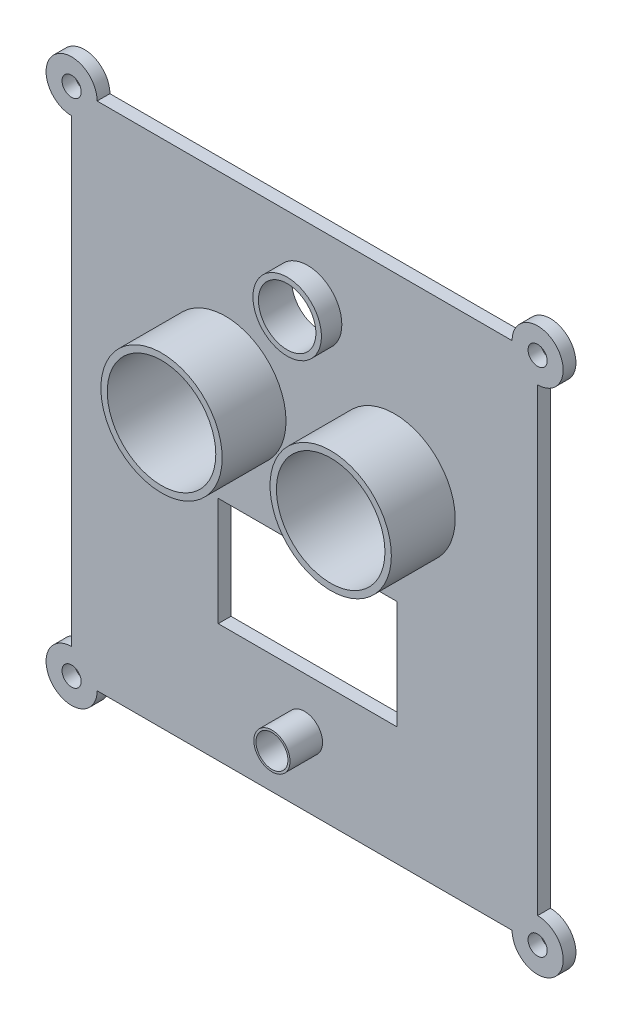
ISO-10303-21;
HEADER;
FILE_DESCRIPTION(('STEP AP214'),'2;1');
FILE_NAME('part.step','',(''),(''),'','','');
FILE_SCHEMA(('AUTOMOTIVE_DESIGN { 1 0 10303 214 1 1 1 1 }'));
ENDSEC;
DATA;
#1=APPLICATION_CONTEXT('core data for automotive mechanical design processes');
#2=APPLICATION_PROTOCOL_DEFINITION('international standard','automotive_design',2000,#1);
#3=PRODUCT_CONTEXT('',#1,'mechanical');
#4=PRODUCT('Part','Part','',(#3));
#5=PRODUCT_RELATED_PRODUCT_CATEGORY('part','',(#4));
#6=PRODUCT_DEFINITION_FORMATION('','',#4);
#7=PRODUCT_DEFINITION_CONTEXT('part definition',#1,'design');
#8=PRODUCT_DEFINITION('design','',#6,#7);
#9=PRODUCT_DEFINITION_SHAPE('','',#8);
#10=(LENGTH_UNIT() NAMED_UNIT(*) SI_UNIT(.MILLI.,.METRE.));
#11=(NAMED_UNIT(*) PLANE_ANGLE_UNIT() SI_UNIT($,.RADIAN.));
#12=(NAMED_UNIT(*) SI_UNIT($,.STERADIAN.) SOLID_ANGLE_UNIT());
#13=UNCERTAINTY_MEASURE_WITH_UNIT(LENGTH_MEASURE(1.E-05),#10,'distance_accuracy_value','');
#14=(GEOMETRIC_REPRESENTATION_CONTEXT(3) GLOBAL_UNCERTAINTY_ASSIGNED_CONTEXT((#13)) GLOBAL_UNIT_ASSIGNED_CONTEXT((#10,
#11,#12)) REPRESENTATION_CONTEXT('',''));
#15=CARTESIAN_POINT('',(0.,0.,0.));
#16=DIRECTION('',(0.,0.,1.));
#17=DIRECTION('',(1.,0.,0.));
#18=AXIS2_PLACEMENT_3D('',#15,#16,#17);
#19=CARTESIAN_POINT('',(0.,0.,2.));
#20=DIRECTION('',(0.,0.,1.));
#21=DIRECTION('',(1.,0.,0.));
#22=AXIS2_PLACEMENT_3D('',#19,#20,#21);
#23=PLANE('',#22);
#24=CARTESIAN_POINT('',(14.0850954924085,21.3730162148261,2.));
#25=DIRECTION('',(0.,0.,1.));
#26=DIRECTION('',(1.,0.,0.));
#27=AXIS2_PLACEMENT_3D('',#24,#25,#26);
#28=CIRCLE('',#27,9.5);
#29=CARTESIAN_POINT('',(23.5850954924085,21.3730162148261,2.));
#30=VERTEX_POINT('',#29);
#31=EDGE_CURVE('E361',#30,#30,#28,.T.);
#32=ORIENTED_EDGE('',*,*,#31,.F.);
#33=EDGE_LOOP('',(#32));
#34=FACE_BOUND('',#33,.T.);
#35=DIRECTION('',(-1.,0.,0.));
#36=VECTOR('',#35,1.);
#37=CARTESIAN_POINT('',(-13.5319148866655,5.58817290968342,2.));
#38=LINE('',#37,#36);
#39=CARTESIAN_POINT('',(14.4680851133345,5.58817290968342,2.));
#40=VERTEX_POINT('',#39);
#41=CARTESIAN_POINT('',(-13.5319148866655,5.58817290968342,2.));
#42=VERTEX_POINT('',#41);
#43=EDGE_CURVE('E185',#40,#42,#38,.T.);
#44=ORIENTED_EDGE('',*,*,#43,.F.);
#45=DIRECTION('',(0.,1.,0.));
#46=VECTOR('',#45,1.);
#47=CARTESIAN_POINT('',(14.4680851133345,-11.4118270903166,2.));
#48=LINE('',#47,#46);
#49=CARTESIAN_POINT('',(14.4680851133345,-11.4118270903166,2.));
#50=VERTEX_POINT('',#49);
#51=EDGE_CURVE('E183',#50,#40,#48,.T.);
#52=ORIENTED_EDGE('',*,*,#51,.F.);
#53=DIRECTION('',(1.,0.,0.));
#54=VECTOR('',#53,1.);
#55=CARTESIAN_POINT('',(-13.5319148866655,-11.4118270903166,2.));
#56=LINE('',#55,#54);
#57=CARTESIAN_POINT('',(-13.5319148866655,-11.4118270903166,2.));
#58=VERTEX_POINT('',#57);
#59=EDGE_CURVE('E191',#58,#50,#56,.T.);
#60=ORIENTED_EDGE('',*,*,#59,.F.);
#61=DIRECTION('',(0.,-1.,0.));
#62=VECTOR('',#61,1.);
#63=CARTESIAN_POINT('',(-13.5319148866655,-11.4118270903166,2.));
#64=LINE('',#63,#62);
#65=EDGE_CURVE('E188',#42,#58,#64,.T.);
#66=ORIENTED_EDGE('',*,*,#65,.F.);
#67=EDGE_LOOP('',(#44,#52,#60,#66));
#68=FACE_BOUND('',#67,.T.);
#69=DIRECTION('',(0.,-1.,0.));
#70=VECTOR('',#69,1.);
#71=CARTESIAN_POINT('',(-36.5,50.,2.));
#72=LINE('',#71,#70);
#73=CARTESIAN_POINT('',(-36.5,46.,2.));
#74=VERTEX_POINT('',#73);
#75=CARTESIAN_POINT('',(-36.5,-26.,2.));
#76=VERTEX_POINT('',#75);
#77=EDGE_CURVE('E226',#74,#76,#72,.T.);
#78=ORIENTED_EDGE('',*,*,#77,.T.);
#79=CARTESIAN_POINT('',(-36.5,-30.,2.));
#80=DIRECTION('',(0.,0.,1.));
#81=DIRECTION('',(1.,0.,0.));
#82=AXIS2_PLACEMENT_3D('',#79,#80,#81);
#83=CIRCLE('',#82,4.00000000000001);
#84=CARTESIAN_POINT('',(-32.5,-30.,2.));
#85=VERTEX_POINT('',#84);
#86=EDGE_CURVE('E149',#76,#85,#83,.T.);
#87=ORIENTED_EDGE('',*,*,#86,.T.);
#88=DIRECTION('',(1.,0.,0.));
#89=VECTOR('',#88,1.);
#90=CARTESIAN_POINT('',(-36.5,-30.,2.));
#91=LINE('',#90,#89);
#92=CARTESIAN_POINT('',(32.5,-30.,2.));
#93=VERTEX_POINT('',#92);
#94=EDGE_CURVE('E142',#85,#93,#91,.T.);
#95=ORIENTED_EDGE('',*,*,#94,.T.);
#96=CARTESIAN_POINT('',(36.5,-30.,2.));
#97=DIRECTION('',(0.,0.,1.));
#98=DIRECTION('',(1.,0.,0.));
#99=AXIS2_PLACEMENT_3D('',#96,#97,#98);
#100=CIRCLE('',#99,4.00000000000001);
#101=CARTESIAN_POINT('',(36.5,-26.,2.));
#102=VERTEX_POINT('',#101);
#103=EDGE_CURVE('E151',#93,#102,#100,.T.);
#104=ORIENTED_EDGE('',*,*,#103,.T.);
#105=DIRECTION('',(0.,1.,0.));
#106=VECTOR('',#105,1.);
#107=CARTESIAN_POINT('',(36.5,50.,2.));
#108=LINE('',#107,#106);
#109=CARTESIAN_POINT('',(36.5,46.,2.));
#110=VERTEX_POINT('',#109);
#111=EDGE_CURVE('E138',#102,#110,#108,.T.);
#112=ORIENTED_EDGE('',*,*,#111,.T.);
#113=CARTESIAN_POINT('',(36.5,50.,2.));
#114=DIRECTION('',(0.,0.,1.));
#115=DIRECTION('',(1.,0.,0.));
#116=AXIS2_PLACEMENT_3D('',#113,#114,#115);
#117=CIRCLE('',#116,4.);
#118=CARTESIAN_POINT('',(32.5,50.,2.));
#119=VERTEX_POINT('',#118);
#120=EDGE_CURVE('E161',#110,#119,#117,.T.);
#121=ORIENTED_EDGE('',*,*,#120,.T.);
#122=DIRECTION('',(-1.,0.,0.));
#123=VECTOR('',#122,1.);
#124=CARTESIAN_POINT('',(-36.5,50.,2.));
#125=LINE('',#124,#123);
#126=CARTESIAN_POINT('',(-32.5,50.,2.));
#127=VERTEX_POINT('',#126);
#128=EDGE_CURVE('E224',#119,#127,#125,.T.);
#129=ORIENTED_EDGE('',*,*,#128,.T.);
#130=CARTESIAN_POINT('',(-36.5,50.,2.));
#131=DIRECTION('',(0.,0.,1.));
#132=DIRECTION('',(1.,0.,0.));
#133=AXIS2_PLACEMENT_3D('',#130,#131,#132);
#134=CIRCLE('',#133,4.);
#135=EDGE_CURVE('E170',#127,#74,#134,.T.);
#136=ORIENTED_EDGE('',*,*,#135,.T.);
#137=EDGE_LOOP('',(#78,#87,#95,#104,#112,#121,#129,#136));
#138=FACE_BOUND('',#137,.T.);
#139=CARTESIAN_POINT('',(-36.5,50.,2.));
#140=DIRECTION('',(0.,0.,1.));
#141=DIRECTION('',(1.,0.,0.));
#142=AXIS2_PLACEMENT_3D('',#139,#140,#141);
#143=CIRCLE('',#142,1.5);
#144=CARTESIAN_POINT('',(-35.,50.,2.));
#145=VERTEX_POINT('',#144);
#146=EDGE_CURVE('E243',#145,#145,#143,.T.);
#147=ORIENTED_EDGE('',*,*,#146,.F.);
#148=EDGE_LOOP('',(#147));
#149=FACE_BOUND('',#148,.T.);
#150=CARTESIAN_POINT('',(36.5,50.,2.));
#151=DIRECTION('',(0.,0.,1.));
#152=DIRECTION('',(1.,0.,0.));
#153=AXIS2_PLACEMENT_3D('',#150,#151,#152);
#154=CIRCLE('',#153,1.5);
#155=CARTESIAN_POINT('',(38.,50.,2.));
#156=VERTEX_POINT('',#155);
#157=EDGE_CURVE('E383',#156,#156,#154,.T.);
#158=ORIENTED_EDGE('',*,*,#157,.F.);
#159=EDGE_LOOP('',(#158));
#160=FACE_BOUND('',#159,.T.);
#161=CARTESIAN_POINT('',(36.5,-30.,2.));
#162=DIRECTION('',(0.,0.,1.));
#163=DIRECTION('',(1.,0.,0.));
#164=AXIS2_PLACEMENT_3D('',#161,#162,#163);
#165=CIRCLE('',#164,1.5);
#166=CARTESIAN_POINT('',(38.,-30.,2.));
#167=VERTEX_POINT('',#166);
#168=EDGE_CURVE('E386',#167,#167,#165,.T.);
#169=ORIENTED_EDGE('',*,*,#168,.F.);
#170=EDGE_LOOP('',(#169));
#171=FACE_BOUND('',#170,.T.);
#172=CARTESIAN_POINT('',(-36.5,-30.,2.));
#173=DIRECTION('',(0.,0.,1.));
#174=DIRECTION('',(1.,0.,0.));
#175=AXIS2_PLACEMENT_3D('',#172,#173,#174);
#176=CIRCLE('',#175,1.5);
#177=CARTESIAN_POINT('',(-35.,-30.,2.));
#178=VERTEX_POINT('',#177);
#179=EDGE_CURVE('E380',#178,#178,#176,.T.);
#180=ORIENTED_EDGE('',*,*,#179,.F.);
#181=EDGE_LOOP('',(#180));
#182=FACE_BOUND('',#181,.T.);
#183=CARTESIAN_POINT('',(-12.4149045075915,21.3730162148261,2.));
#184=DIRECTION('',(0.,0.,1.));
#185=DIRECTION('',(1.,0.,0.));
#186=AXIS2_PLACEMENT_3D('',#183,#184,#185);
#187=CIRCLE('',#186,9.5);
#188=CARTESIAN_POINT('',(-2.91490450759145,21.3730162148261,2.));
#189=VERTEX_POINT('',#188);
#190=EDGE_CURVE('E376',#189,#189,#187,.T.);
#191=ORIENTED_EDGE('',*,*,#190,.F.);
#192=EDGE_LOOP('',(#191));
#193=FACE_BOUND('',#192,.T.);
#194=CARTESIAN_POINT('',(0.468085113334515,38.8342075289515,2.));
#195=DIRECTION('',(0.,0.,1.));
#196=DIRECTION('',(1.,0.,0.));
#197=AXIS2_PLACEMENT_3D('',#194,#195,#196);
#198=CIRCLE('',#197,5.36058410056267);
#199=CARTESIAN_POINT('',(5.82866921389718,38.8342075289515,2.));
#200=VERTEX_POINT('',#199);
#201=EDGE_CURVE('E11',#200,#200,#198,.T.);
#202=ORIENTED_EDGE('',*,*,#201,.F.);
#203=EDGE_LOOP('',(#202));
#204=FACE_BOUND('',#203,.T.);
#205=CARTESIAN_POINT('',(-0.0200600855697619,-19.3748058229429,2.));
#206=DIRECTION('',(0.,0.,1.));
#207=DIRECTION('',(1.,0.,0.));
#208=AXIS2_PLACEMENT_3D('',#205,#206,#207);
#209=CIRCLE('',#208,2.83396685731495);
#210=CARTESIAN_POINT('',(2.81390677174518,-19.3748058229429,2.));
#211=VERTEX_POINT('',#210);
#212=EDGE_CURVE('E406',#211,#211,#209,.T.);
#213=ORIENTED_EDGE('',*,*,#212,.F.);
#214=EDGE_LOOP('',(#213));
#215=FACE_BOUND('',#214,.T.);
#216=ADVANCED_FACE('F37',(#34,#68,#138,#149,#160,#171,#182,#193,#204,#215),#23,.T.);
#217=CARTESIAN_POINT('',(0.,0.,0.));
#218=DIRECTION('',(0.,0.,1.));
#219=DIRECTION('',(1.,0.,0.));
#220=AXIS2_PLACEMENT_3D('',#217,#218,#219);
#221=PLANE('',#220);
#222=CARTESIAN_POINT('',(-36.5,-30.,0.));
#223=DIRECTION('',(0.,0.,1.));
#224=DIRECTION('',(1.,0.,0.));
#225=AXIS2_PLACEMENT_3D('',#222,#223,#224);
#226=CIRCLE('',#225,1.5);
#227=CARTESIAN_POINT('',(-35.,-30.,0.));
#228=VERTEX_POINT('',#227);
#229=EDGE_CURVE('E41',#228,#228,#226,.T.);
#230=ORIENTED_EDGE('',*,*,#229,.T.);
#231=EDGE_LOOP('',(#230));
#232=FACE_BOUND('',#231,.T.);
#233=CARTESIAN_POINT('',(36.5,-30.,0.));
#234=DIRECTION('',(0.,0.,1.));
#235=DIRECTION('',(1.,0.,0.));
#236=AXIS2_PLACEMENT_3D('',#233,#234,#235);
#237=CIRCLE('',#236,1.5);
#238=CARTESIAN_POINT('',(38.,-30.,0.));
#239=VERTEX_POINT('',#238);
#240=EDGE_CURVE('E245',#239,#239,#237,.T.);
#241=ORIENTED_EDGE('',*,*,#240,.T.);
#242=EDGE_LOOP('',(#241));
#243=FACE_BOUND('',#242,.T.);
#244=CARTESIAN_POINT('',(36.5,50.,0.));
#245=DIRECTION('',(0.,0.,1.));
#246=DIRECTION('',(1.,0.,0.));
#247=AXIS2_PLACEMENT_3D('',#244,#245,#246);
#248=CIRCLE('',#247,1.5);
#249=CARTESIAN_POINT('',(38.,50.,0.));
#250=VERTEX_POINT('',#249);
#251=EDGE_CURVE('E242',#250,#250,#248,.T.);
#252=ORIENTED_EDGE('',*,*,#251,.T.);
#253=EDGE_LOOP('',(#252));
#254=FACE_BOUND('',#253,.T.);
#255=CARTESIAN_POINT('',(-36.5,50.,0.));
#256=DIRECTION('',(0.,0.,1.));
#257=DIRECTION('',(1.,0.,0.));
#258=AXIS2_PLACEMENT_3D('',#255,#256,#257);
#259=CIRCLE('',#258,1.5);
#260=CARTESIAN_POINT('',(-35.,50.,0.));
#261=VERTEX_POINT('',#260);
#262=EDGE_CURVE('E239',#261,#261,#259,.T.);
#263=ORIENTED_EDGE('',*,*,#262,.T.);
#264=EDGE_LOOP('',(#263));
#265=FACE_BOUND('',#264,.T.);
#266=CARTESIAN_POINT('',(14.0850954924085,21.3730162148261,0.));
#267=DIRECTION('',(0.,0.,1.));
#268=DIRECTION('',(1.,0.,0.));
#269=AXIS2_PLACEMENT_3D('',#266,#267,#268);
#270=CIRCLE('',#269,8.5);
#271=CARTESIAN_POINT('',(22.5850954924085,21.3730162148261,0.));
#272=VERTEX_POINT('',#271);
#273=EDGE_CURVE('E216',#272,#272,#270,.T.);
#274=ORIENTED_EDGE('',*,*,#273,.T.);
#275=EDGE_LOOP('',(#274));
#276=FACE_BOUND('',#275,.T.);
#277=CARTESIAN_POINT('',(-12.4149045075915,21.3730162148261,0.));
#278=DIRECTION('',(0.,0.,1.));
#279=DIRECTION('',(1.,0.,0.));
#280=AXIS2_PLACEMENT_3D('',#277,#278,#279);
#281=CIRCLE('',#280,8.5);
#282=CARTESIAN_POINT('',(-3.91490450759145,21.3730162148261,0.));
#283=VERTEX_POINT('',#282);
#284=EDGE_CURVE('E219',#283,#283,#281,.T.);
#285=ORIENTED_EDGE('',*,*,#284,.T.);
#286=EDGE_LOOP('',(#285));
#287=FACE_BOUND('',#286,.T.);
#288=DIRECTION('',(1.,0.,0.));
#289=VECTOR('',#288,1.);
#290=CARTESIAN_POINT('',(-36.5,-30.,0.));
#291=LINE('',#290,#289);
#292=CARTESIAN_POINT('',(-32.5,-30.,0.));
#293=VERTEX_POINT('',#292);
#294=CARTESIAN_POINT('',(32.5,-30.,0.));
#295=VERTEX_POINT('',#294);
#296=EDGE_CURVE('E126',#293,#295,#291,.T.);
#297=ORIENTED_EDGE('',*,*,#296,.F.);
#298=CARTESIAN_POINT('',(-36.5,-30.,0.));
#299=DIRECTION('',(0.,0.,1.));
#300=DIRECTION('',(1.,0.,0.));
#301=AXIS2_PLACEMENT_3D('',#298,#299,#300);
#302=CIRCLE('',#301,4.00000000000001);
#303=CARTESIAN_POINT('',(-36.5,-26.,0.));
#304=VERTEX_POINT('',#303);
#305=EDGE_CURVE('E131',#293,#304,#302,.F.);
#306=ORIENTED_EDGE('',*,*,#305,.T.);
#307=DIRECTION('',(0.,-1.,0.));
#308=VECTOR('',#307,1.);
#309=CARTESIAN_POINT('',(-36.5,50.,0.));
#310=LINE('',#309,#308);
#311=CARTESIAN_POINT('',(-36.5,46.,0.));
#312=VERTEX_POINT('',#311);
#313=EDGE_CURVE('E54',#312,#304,#310,.T.);
#314=ORIENTED_EDGE('',*,*,#313,.F.);
#315=CARTESIAN_POINT('',(-36.5,50.,0.));
#316=DIRECTION('',(0.,0.,1.));
#317=DIRECTION('',(1.,0.,0.));
#318=AXIS2_PLACEMENT_3D('',#315,#316,#317);
#319=CIRCLE('',#318,4.);
#320=CARTESIAN_POINT('',(-32.5,50.,0.));
#321=VERTEX_POINT('',#320);
#322=EDGE_CURVE('E173',#312,#321,#319,.F.);
#323=ORIENTED_EDGE('',*,*,#322,.T.);
#324=DIRECTION('',(-1.,0.,0.));
#325=VECTOR('',#324,1.);
#326=CARTESIAN_POINT('',(-36.5,50.,0.));
#327=LINE('',#326,#325);
#328=CARTESIAN_POINT('',(32.5,50.,0.));
#329=VERTEX_POINT('',#328);
#330=EDGE_CURVE('E231',#329,#321,#327,.T.);
#331=ORIENTED_EDGE('',*,*,#330,.F.);
#332=CARTESIAN_POINT('',(36.5,50.,0.));
#333=DIRECTION('',(0.,0.,1.));
#334=DIRECTION('',(1.,0.,0.));
#335=AXIS2_PLACEMENT_3D('',#332,#333,#334);
#336=CIRCLE('',#335,4.);
#337=CARTESIAN_POINT('',(36.5,46.,0.));
#338=VERTEX_POINT('',#337);
#339=EDGE_CURVE('E164',#329,#338,#336,.F.);
#340=ORIENTED_EDGE('',*,*,#339,.T.);
#341=DIRECTION('',(0.,1.,0.));
#342=VECTOR('',#341,1.);
#343=CARTESIAN_POINT('',(36.5,50.,0.));
#344=LINE('',#343,#342);
#345=CARTESIAN_POINT('',(36.5,-26.,0.));
#346=VERTEX_POINT('',#345);
#347=EDGE_CURVE('E222',#346,#338,#344,.T.);
#348=ORIENTED_EDGE('',*,*,#347,.F.);
#349=CARTESIAN_POINT('',(36.5,-30.,0.));
#350=DIRECTION('',(0.,0.,1.));
#351=DIRECTION('',(1.,0.,0.));
#352=AXIS2_PLACEMENT_3D('',#349,#350,#351);
#353=CIRCLE('',#352,4.00000000000001);
#354=EDGE_CURVE('E134',#346,#295,#353,.F.);
#355=ORIENTED_EDGE('',*,*,#354,.T.);
#356=EDGE_LOOP('',(#297,#306,#314,#323,#331,#340,#348,#355));
#357=FACE_BOUND('',#356,.T.);
#358=DIRECTION('',(0.,1.,0.));
#359=VECTOR('',#358,1.);
#360=CARTESIAN_POINT('',(14.4680851133345,-11.4118270903166,0.));
#361=LINE('',#360,#359);
#362=CARTESIAN_POINT('',(14.4680851133345,-11.4118270903166,0.));
#363=VERTEX_POINT('',#362);
#364=CARTESIAN_POINT('',(14.4680851133345,5.58817290968342,0.));
#365=VERTEX_POINT('',#364);
#366=EDGE_CURVE('E182',#363,#365,#361,.T.);
#367=ORIENTED_EDGE('',*,*,#366,.T.);
#368=DIRECTION('',(-1.,0.,0.));
#369=VECTOR('',#368,1.);
#370=CARTESIAN_POINT('',(-13.5319148866655,5.58817290968342,0.));
#371=LINE('',#370,#369);
#372=CARTESIAN_POINT('',(-13.5319148866655,5.58817290968342,0.));
#373=VERTEX_POINT('',#372);
#374=EDGE_CURVE('E196',#365,#373,#371,.T.);
#375=ORIENTED_EDGE('',*,*,#374,.T.);
#376=DIRECTION('',(0.,-1.,0.));
#377=VECTOR('',#376,1.);
#378=CARTESIAN_POINT('',(-13.5319148866655,-11.4118270903166,0.));
#379=LINE('',#378,#377);
#380=CARTESIAN_POINT('',(-13.5319148866655,-11.4118270903166,0.));
#381=VERTEX_POINT('',#380);
#382=EDGE_CURVE('E199',#373,#381,#379,.T.);
#383=ORIENTED_EDGE('',*,*,#382,.T.);
#384=DIRECTION('',(1.,0.,0.));
#385=VECTOR('',#384,1.);
#386=CARTESIAN_POINT('',(-13.5319148866655,-11.4118270903166,0.));
#387=LINE('',#386,#385);
#388=EDGE_CURVE('E186',#381,#363,#387,.T.);
#389=ORIENTED_EDGE('',*,*,#388,.T.);
#390=EDGE_LOOP('',(#367,#375,#383,#389));
#391=FACE_BOUND('',#390,.T.);
#392=CARTESIAN_POINT('',(-0.0200600855697619,-19.3748058229429,0.));
#393=DIRECTION('',(0.,0.,1.));
#394=DIRECTION('',(1.,0.,0.));
#395=AXIS2_PLACEMENT_3D('',#392,#393,#394);
#396=CIRCLE('',#395,2.5);
#397=CARTESIAN_POINT('',(2.47993991443024,-19.3748058229429,0.));
#398=VERTEX_POINT('',#397);
#399=EDGE_CURVE('E179',#398,#398,#396,.T.);
#400=ORIENTED_EDGE('',*,*,#399,.T.);
#401=EDGE_LOOP('',(#400));
#402=FACE_BOUND('',#401,.T.);
#403=CARTESIAN_POINT('',(0.468085113334515,38.8342075289515,0.));
#404=DIRECTION('',(0.,0.,1.));
#405=DIRECTION('',(1.,0.,0.));
#406=AXIS2_PLACEMENT_3D('',#403,#404,#405);
#407=CIRCLE('',#406,4.5);
#408=CARTESIAN_POINT('',(4.96808511333452,38.8342075289515,0.));
#409=VERTEX_POINT('',#408);
#410=EDGE_CURVE('E213',#409,#409,#407,.T.);
#411=ORIENTED_EDGE('',*,*,#410,.T.);
#412=EDGE_LOOP('',(#411));
#413=FACE_BOUND('',#412,.T.);
#414=ADVANCED_FACE('F128',(#232,#243,#254,#265,#276,#287,#357,#391,#402,#413),#221,.F.);
#415=CARTESIAN_POINT('',(36.5,50.,2.));
#416=DIRECTION('',(-1.,0.,0.));
#417=DIRECTION('',(0.,-1.,0.));
#418=AXIS2_PLACEMENT_3D('',#415,#416,#417);
#419=PLANE('',#418);
#420=ORIENTED_EDGE('',*,*,#111,.F.);
#421=DIRECTION('',(0.,0.,1.));
#422=VECTOR('',#421,1.);
#423=CARTESIAN_POINT('',(36.5,-26.,-11.3137084989848));
#424=LINE('',#423,#422);
#425=EDGE_CURVE('E159',#102,#346,#424,.F.);
#426=ORIENTED_EDGE('',*,*,#425,.T.);
#427=ORIENTED_EDGE('',*,*,#347,.T.);
#428=DIRECTION('',(0.,0.,1.));
#429=VECTOR('',#428,1.);
#430=CARTESIAN_POINT('',(36.5,46.,-11.3137084989848));
#431=LINE('',#430,#429);
#432=EDGE_CURVE('E167',#338,#110,#431,.T.);
#433=ORIENTED_EDGE('',*,*,#432,.T.);
#434=EDGE_LOOP('',(#420,#426,#427,#433));
#435=FACE_BOUND('',#434,.T.);
#436=ADVANCED_FACE('F39',(#435),#419,.F.);
#437=CARTESIAN_POINT('',(-36.5,50.,2.));
#438=DIRECTION('',(0.,-1.,0.));
#439=DIRECTION('',(0.,0.,-1.));
#440=AXIS2_PLACEMENT_3D('',#437,#438,#439);
#441=PLANE('',#440);
#442=ORIENTED_EDGE('',*,*,#128,.F.);
#443=DIRECTION('',(0.,0.,1.));
#444=VECTOR('',#443,1.);
#445=CARTESIAN_POINT('',(32.5,50.,-11.3137084989848));
#446=LINE('',#445,#444);
#447=EDGE_CURVE('E235',#119,#329,#446,.F.);
#448=ORIENTED_EDGE('',*,*,#447,.T.);
#449=ORIENTED_EDGE('',*,*,#330,.T.);
#450=DIRECTION('',(0.,0.,1.));
#451=VECTOR('',#450,1.);
#452=CARTESIAN_POINT('',(-32.5,50.,-11.3137084989848));
#453=LINE('',#452,#451);
#454=EDGE_CURVE('E176',#321,#127,#453,.T.);
#455=ORIENTED_EDGE('',*,*,#454,.T.);
#456=EDGE_LOOP('',(#442,#448,#449,#455));
#457=FACE_BOUND('',#456,.T.);
#458=ADVANCED_FACE('F288',(#457),#441,.F.);
#459=CARTESIAN_POINT('',(-36.5,50.,2.));
#460=DIRECTION('',(1.,0.,0.));
#461=DIRECTION('',(0.,1.,0.));
#462=AXIS2_PLACEMENT_3D('',#459,#460,#461);
#463=PLANE('',#462);
#464=ORIENTED_EDGE('',*,*,#313,.T.);
#465=DIRECTION('',(0.,0.,1.));
#466=VECTOR('',#465,1.);
#467=CARTESIAN_POINT('',(-36.5,-26.,-11.3137084989848));
#468=LINE('',#467,#466);
#469=EDGE_CURVE('E58',#304,#76,#468,.T.);
#470=ORIENTED_EDGE('',*,*,#469,.T.);
#471=ORIENTED_EDGE('',*,*,#77,.F.);
#472=DIRECTION('',(0.,0.,1.));
#473=VECTOR('',#472,1.);
#474=CARTESIAN_POINT('',(-36.5,46.,-11.3137084989848));
#475=LINE('',#474,#473);
#476=EDGE_CURVE('E229',#74,#312,#475,.F.);
#477=ORIENTED_EDGE('',*,*,#476,.T.);
#478=EDGE_LOOP('',(#464,#470,#471,#477));
#479=FACE_BOUND('',#478,.T.);
#480=ADVANCED_FACE('F286',(#479),#463,.F.);
#481=CARTESIAN_POINT('',(-36.5,-30.,2.));
#482=DIRECTION('',(0.,1.,0.));
#483=DIRECTION('',(0.,0.,1.));
#484=AXIS2_PLACEMENT_3D('',#481,#482,#483);
#485=PLANE('',#484);
#486=ORIENTED_EDGE('',*,*,#94,.F.);
#487=DIRECTION('',(0.,0.,1.));
#488=VECTOR('',#487,1.);
#489=CARTESIAN_POINT('',(-32.5,-30.,-11.3137084989848));
#490=LINE('',#489,#488);
#491=EDGE_CURVE('E46',#85,#293,#490,.F.);
#492=ORIENTED_EDGE('',*,*,#491,.T.);
#493=ORIENTED_EDGE('',*,*,#296,.T.);
#494=DIRECTION('',(0.,0.,1.));
#495=VECTOR('',#494,1.);
#496=CARTESIAN_POINT('',(32.5,-30.,-11.3137084989848));
#497=LINE('',#496,#495);
#498=EDGE_CURVE('E146',#295,#93,#497,.T.);
#499=ORIENTED_EDGE('',*,*,#498,.T.);
#500=EDGE_LOOP('',(#486,#492,#493,#499));
#501=FACE_BOUND('',#500,.T.);
#502=ADVANCED_FACE('F141',(#501),#485,.F.);
#503=CARTESIAN_POINT('',(-12.4149045075915,21.3730162148261,2.));
#504=DIRECTION('',(0.,0.,-1.));
#505=DIRECTION('',(-1.,0.,0.));
#506=AXIS2_PLACEMENT_3D('',#503,#504,#505);
#507=CYLINDRICAL_SURFACE('',#506,8.5);
#508=ORIENTED_EDGE('',*,*,#284,.F.);
#509=EDGE_LOOP('',(#508));
#510=FACE_BOUND('',#509,.T.);
#511=CARTESIAN_POINT('',(-12.4149045075915,21.3730162148261,12.));
#512=DIRECTION('',(0.,0.,1.));
#513=DIRECTION('',(1.,0.,0.));
#514=AXIS2_PLACEMENT_3D('',#511,#512,#513);
#515=CIRCLE('',#514,8.5);
#516=CARTESIAN_POINT('',(-3.91490450759145,21.3730162148261,12.));
#517=VERTEX_POINT('',#516);
#518=EDGE_CURVE('E372',#517,#517,#515,.T.);
#519=ORIENTED_EDGE('',*,*,#518,.T.);
#520=EDGE_LOOP('',(#519));
#521=FACE_BOUND('',#520,.T.);
#522=ADVANCED_FACE('F281',(#510,#521),#507,.F.);
#523=CARTESIAN_POINT('',(14.0850954924085,21.3730162148261,2.));
#524=DIRECTION('',(0.,0.,-1.));
#525=DIRECTION('',(-1.,0.,0.));
#526=AXIS2_PLACEMENT_3D('',#523,#524,#525);
#527=CYLINDRICAL_SURFACE('',#526,8.5);
#528=ORIENTED_EDGE('',*,*,#273,.F.);
#529=EDGE_LOOP('',(#528));
#530=FACE_BOUND('',#529,.T.);
#531=CARTESIAN_POINT('',(14.0850954924085,21.3730162148261,12.));
#532=DIRECTION('',(0.,0.,1.));
#533=DIRECTION('',(1.,0.,0.));
#534=AXIS2_PLACEMENT_3D('',#531,#532,#533);
#535=CIRCLE('',#534,8.5);
#536=CARTESIAN_POINT('',(22.5850954924085,21.3730162148261,12.));
#537=VERTEX_POINT('',#536);
#538=EDGE_CURVE('E359',#537,#537,#535,.T.);
#539=ORIENTED_EDGE('',*,*,#538,.T.);
#540=EDGE_LOOP('',(#539));
#541=FACE_BOUND('',#540,.T.);
#542=ADVANCED_FACE('F347',(#530,#541),#527,.F.);
#543=CARTESIAN_POINT('',(0.468085113334515,38.8342075289515,2.));
#544=DIRECTION('',(0.,0.,-1.));
#545=DIRECTION('',(-1.,0.,0.));
#546=AXIS2_PLACEMENT_3D('',#543,#544,#545);
#547=CYLINDRICAL_SURFACE('',#546,4.5);
#548=ORIENTED_EDGE('',*,*,#410,.F.);
#549=EDGE_LOOP('',(#548));
#550=FACE_BOUND('',#549,.T.);
#551=CARTESIAN_POINT('',(0.468085113334515,38.8342075289515,5.2));
#552=DIRECTION('',(0.,0.,-1.));
#553=DIRECTION('',(-1.,0.,0.));
#554=AXIS2_PLACEMENT_3D('',#551,#552,#553);
#555=CIRCLE('',#554,4.5);
#556=CARTESIAN_POINT('',(-4.03191488666548,38.8342075289515,5.2));
#557=VERTEX_POINT('',#556);
#558=EDGE_CURVE('E368',#557,#557,#555,.T.);
#559=ORIENTED_EDGE('',*,*,#558,.F.);
#560=EDGE_LOOP('',(#559));
#561=FACE_BOUND('',#560,.T.);
#562=ADVANCED_FACE('F344',(#550,#561),#547,.F.);
#563=CARTESIAN_POINT('',(14.4680851133345,-11.4118270903166,2.));
#564=DIRECTION('',(-1.,0.,0.));
#565=DIRECTION('',(0.,-1.,0.));
#566=AXIS2_PLACEMENT_3D('',#563,#564,#565);
#567=PLANE('',#566);
#568=ORIENTED_EDGE('',*,*,#366,.F.);
#569=DIRECTION('',(0.,0.,-1.));
#570=VECTOR('',#569,1.);
#571=CARTESIAN_POINT('',(14.4680851133345,-11.4118270903166,2.));
#572=LINE('',#571,#570);
#573=EDGE_CURVE('E193',#50,#363,#572,.T.);
#574=ORIENTED_EDGE('',*,*,#573,.F.);
#575=ORIENTED_EDGE('',*,*,#51,.T.);
#576=DIRECTION('',(0.,0.,-1.));
#577=VECTOR('',#576,1.);
#578=CARTESIAN_POINT('',(14.4680851133345,5.58817290968342,2.));
#579=LINE('',#578,#577);
#580=EDGE_CURVE('E210',#40,#365,#579,.T.);
#581=ORIENTED_EDGE('',*,*,#580,.T.);
#582=EDGE_LOOP('',(#568,#574,#575,#581));
#583=FACE_BOUND('',#582,.T.);
#584=ADVANCED_FACE('F340',(#583),#567,.T.);
#585=CARTESIAN_POINT('',(-13.5319148866655,5.58817290968342,2.));
#586=DIRECTION('',(0.,-1.,0.));
#587=DIRECTION('',(0.,0.,-1.));
#588=AXIS2_PLACEMENT_3D('',#585,#586,#587);
#589=PLANE('',#588);
#590=ORIENTED_EDGE('',*,*,#374,.F.);
#591=ORIENTED_EDGE('',*,*,#580,.F.);
#592=ORIENTED_EDGE('',*,*,#43,.T.);
#593=DIRECTION('',(0.,0.,-1.));
#594=VECTOR('',#593,1.);
#595=CARTESIAN_POINT('',(-13.5319148866655,5.58817290968342,2.));
#596=LINE('',#595,#594);
#597=EDGE_CURVE('E208',#42,#373,#596,.T.);
#598=ORIENTED_EDGE('',*,*,#597,.T.);
#599=EDGE_LOOP('',(#590,#591,#592,#598));
#600=FACE_BOUND('',#599,.T.);
#601=ADVANCED_FACE('F336',(#600),#589,.T.);
#602=CARTESIAN_POINT('',(-13.5319148866655,-11.4118270903166,2.));
#603=DIRECTION('',(1.,0.,0.));
#604=DIRECTION('',(0.,1.,0.));
#605=AXIS2_PLACEMENT_3D('',#602,#603,#604);
#606=PLANE('',#605);
#607=ORIENTED_EDGE('',*,*,#382,.F.);
#608=ORIENTED_EDGE('',*,*,#597,.F.);
#609=ORIENTED_EDGE('',*,*,#65,.T.);
#610=DIRECTION('',(0.,0.,-1.));
#611=VECTOR('',#610,1.);
#612=CARTESIAN_POINT('',(-13.5319148866655,-11.4118270903166,2.));
#613=LINE('',#612,#611);
#614=EDGE_CURVE('E206',#58,#381,#613,.T.);
#615=ORIENTED_EDGE('',*,*,#614,.T.);
#616=EDGE_LOOP('',(#607,#608,#609,#615));
#617=FACE_BOUND('',#616,.T.);
#618=ADVANCED_FACE('F332',(#617),#606,.T.);
#619=CARTESIAN_POINT('',(-13.5319148866655,-11.4118270903166,2.));
#620=DIRECTION('',(0.,1.,0.));
#621=DIRECTION('',(0.,0.,1.));
#622=AXIS2_PLACEMENT_3D('',#619,#620,#621);
#623=PLANE('',#622);
#624=ORIENTED_EDGE('',*,*,#388,.F.);
#625=ORIENTED_EDGE('',*,*,#614,.F.);
#626=ORIENTED_EDGE('',*,*,#59,.T.);
#627=ORIENTED_EDGE('',*,*,#573,.T.);
#628=EDGE_LOOP('',(#624,#625,#626,#627));
#629=FACE_BOUND('',#628,.T.);
#630=ADVANCED_FACE('F328',(#629),#623,.T.);
#631=CARTESIAN_POINT('',(-0.0200600855697619,-19.3748058229429,2.));
#632=DIRECTION('',(0.,0.,-1.));
#633=DIRECTION('',(-1.,0.,0.));
#634=AXIS2_PLACEMENT_3D('',#631,#632,#633);
#635=CYLINDRICAL_SURFACE('',#634,2.5);
#636=ORIENTED_EDGE('',*,*,#399,.F.);
#637=EDGE_LOOP('',(#636));
#638=FACE_BOUND('',#637,.T.);
#639=CARTESIAN_POINT('',(-0.0200600855697619,-19.3748058229429,7.1));
#640=DIRECTION('',(0.,0.,1.));
#641=DIRECTION('',(1.,0.,0.));
#642=AXIS2_PLACEMENT_3D('',#639,#640,#641);
#643=CIRCLE('',#642,2.5);
#644=CARTESIAN_POINT('',(2.47993991443024,-19.3748058229429,7.1));
#645=VERTEX_POINT('',#644);
#646=EDGE_CURVE('E409',#645,#645,#643,.T.);
#647=ORIENTED_EDGE('',*,*,#646,.T.);
#648=EDGE_LOOP('',(#647));
#649=FACE_BOUND('',#648,.T.);
#650=ADVANCED_FACE('F325',(#638,#649),#635,.F.);
#651=CARTESIAN_POINT('',(-36.5,50.,-11.3137084989848));
#652=DIRECTION('',(0.,0.,1.));
#653=DIRECTION('',(1.,0.,0.));
#654=AXIS2_PLACEMENT_3D('',#651,#652,#653);
#655=CYLINDRICAL_SURFACE('',#654,4.);
#656=ORIENTED_EDGE('',*,*,#454,.F.);
#657=ORIENTED_EDGE('',*,*,#322,.F.);
#658=ORIENTED_EDGE('',*,*,#476,.F.);
#659=ORIENTED_EDGE('',*,*,#135,.F.);
#660=EDGE_LOOP('',(#656,#657,#658,#659));
#661=FACE_BOUND('',#660,.T.);
#662=ADVANCED_FACE('F309',(#661),#655,.T.);
#663=CARTESIAN_POINT('',(36.5,50.,-11.3137084989848));
#664=DIRECTION('',(0.,0.,1.));
#665=DIRECTION('',(1.,0.,0.));
#666=AXIS2_PLACEMENT_3D('',#663,#664,#665);
#667=CYLINDRICAL_SURFACE('',#666,4.);
#668=ORIENTED_EDGE('',*,*,#432,.F.);
#669=ORIENTED_EDGE('',*,*,#339,.F.);
#670=ORIENTED_EDGE('',*,*,#447,.F.);
#671=ORIENTED_EDGE('',*,*,#120,.F.);
#672=EDGE_LOOP('',(#668,#669,#670,#671));
#673=FACE_BOUND('',#672,.T.);
#674=ADVANCED_FACE('F303',(#673),#667,.T.);
#675=CARTESIAN_POINT('',(36.5,-30.,-11.3137084989848));
#676=DIRECTION('',(0.,0.,1.));
#677=DIRECTION('',(1.,0.,0.));
#678=AXIS2_PLACEMENT_3D('',#675,#676,#677);
#679=CYLINDRICAL_SURFACE('',#678,4.00000000000001);
#680=ORIENTED_EDGE('',*,*,#425,.F.);
#681=ORIENTED_EDGE('',*,*,#103,.F.);
#682=ORIENTED_EDGE('',*,*,#498,.F.);
#683=ORIENTED_EDGE('',*,*,#354,.F.);
#684=EDGE_LOOP('',(#680,#681,#682,#683));
#685=FACE_BOUND('',#684,.T.);
#686=ADVANCED_FACE('F312',(#685),#679,.T.);
#687=CARTESIAN_POINT('',(-36.5,-30.,-11.3137084989848));
#688=DIRECTION('',(0.,0.,1.));
#689=DIRECTION('',(1.,0.,0.));
#690=AXIS2_PLACEMENT_3D('',#687,#688,#689);
#691=CYLINDRICAL_SURFACE('',#690,4.00000000000001);
#692=ORIENTED_EDGE('',*,*,#469,.F.);
#693=ORIENTED_EDGE('',*,*,#305,.F.);
#694=ORIENTED_EDGE('',*,*,#491,.F.);
#695=ORIENTED_EDGE('',*,*,#86,.F.);
#696=EDGE_LOOP('',(#692,#693,#694,#695));
#697=FACE_BOUND('',#696,.T.);
#698=ADVANCED_FACE('F148',(#697),#691,.T.);
#699=CARTESIAN_POINT('',(-36.5,50.,-8.));
#700=DIRECTION('',(0.,0.,1.));
#701=DIRECTION('',(1.,0.,0.));
#702=AXIS2_PLACEMENT_3D('',#699,#700,#701);
#703=CYLINDRICAL_SURFACE('',#702,1.5);
#704=ORIENTED_EDGE('',*,*,#146,.T.);
#705=EDGE_LOOP('',(#704));
#706=FACE_BOUND('',#705,.T.);
#707=ORIENTED_EDGE('',*,*,#262,.F.);
#708=EDGE_LOOP('',(#707));
#709=FACE_BOUND('',#708,.T.);
#710=ADVANCED_FACE('F319',(#706,#709),#703,.F.);
#711=CARTESIAN_POINT('',(36.5,50.,-8.));
#712=DIRECTION('',(0.,0.,1.));
#713=DIRECTION('',(1.,0.,0.));
#714=AXIS2_PLACEMENT_3D('',#711,#712,#713);
#715=CYLINDRICAL_SURFACE('',#714,1.5);
#716=ORIENTED_EDGE('',*,*,#157,.T.);
#717=EDGE_LOOP('',(#716));
#718=FACE_BOUND('',#717,.T.);
#719=ORIENTED_EDGE('',*,*,#251,.F.);
#720=EDGE_LOOP('',(#719));
#721=FACE_BOUND('',#720,.T.);
#722=ADVANCED_FACE('F266',(#718,#721),#715,.F.);
#723=CARTESIAN_POINT('',(36.5,-30.,-8.));
#724=DIRECTION('',(0.,0.,1.));
#725=DIRECTION('',(1.,0.,0.));
#726=AXIS2_PLACEMENT_3D('',#723,#724,#725);
#727=CYLINDRICAL_SURFACE('',#726,1.5);
#728=ORIENTED_EDGE('',*,*,#168,.T.);
#729=EDGE_LOOP('',(#728));
#730=FACE_BOUND('',#729,.T.);
#731=ORIENTED_EDGE('',*,*,#240,.F.);
#732=EDGE_LOOP('',(#731));
#733=FACE_BOUND('',#732,.T.);
#734=ADVANCED_FACE('F256',(#730,#733),#727,.F.);
#735=CARTESIAN_POINT('',(-36.5,-30.,-8.));
#736=DIRECTION('',(0.,0.,1.));
#737=DIRECTION('',(1.,0.,0.));
#738=AXIS2_PLACEMENT_3D('',#735,#736,#737);
#739=CYLINDRICAL_SURFACE('',#738,1.5);
#740=ORIENTED_EDGE('',*,*,#179,.T.);
#741=EDGE_LOOP('',(#740));
#742=FACE_BOUND('',#741,.T.);
#743=ORIENTED_EDGE('',*,*,#229,.F.);
#744=EDGE_LOOP('',(#743));
#745=FACE_BOUND('',#744,.T.);
#746=ADVANCED_FACE('F253',(#742,#745),#739,.F.);
#747=CARTESIAN_POINT('',(-12.4149045075915,21.3730162148261,12.));
#748=DIRECTION('',(0.,0.,1.));
#749=DIRECTION('',(1.,0.,0.));
#750=AXIS2_PLACEMENT_3D('',#747,#748,#749);
#751=PLANE('',#750);
#752=CARTESIAN_POINT('',(-12.4149045075915,21.3730162148261,12.));
#753=DIRECTION('',(0.,0.,1.));
#754=DIRECTION('',(1.,0.,0.));
#755=AXIS2_PLACEMENT_3D('',#752,#753,#754);
#756=CIRCLE('',#755,9.5);
#757=CARTESIAN_POINT('',(-2.91490450759145,21.3730162148261,12.));
#758=VERTEX_POINT('',#757);
#759=EDGE_CURVE('E377',#758,#758,#756,.T.);
#760=ORIENTED_EDGE('',*,*,#759,.T.);
#761=EDGE_LOOP('',(#760));
#762=FACE_BOUND('',#761,.T.);
#763=ORIENTED_EDGE('',*,*,#518,.F.);
#764=EDGE_LOOP('',(#763));
#765=FACE_BOUND('',#764,.T.);
#766=ADVANCED_FACE('F255',(#762,#765),#751,.T.);
#767=CARTESIAN_POINT('',(-12.4149045075915,21.3730162148261,12.));
#768=DIRECTION('',(0.,0.,-1.));
#769=DIRECTION('',(-1.,0.,0.));
#770=AXIS2_PLACEMENT_3D('',#767,#768,#769);
#771=CYLINDRICAL_SURFACE('',#770,9.5);
#772=ORIENTED_EDGE('',*,*,#759,.F.);
#773=EDGE_LOOP('',(#772));
#774=FACE_BOUND('',#773,.T.);
#775=ORIENTED_EDGE('',*,*,#190,.T.);
#776=EDGE_LOOP('',(#775));
#777=FACE_BOUND('',#776,.T.);
#778=ADVANCED_FACE('F263',(#774,#777),#771,.T.);
#779=CARTESIAN_POINT('',(14.0850954924085,21.3730162148261,12.));
#780=DIRECTION('',(0.,0.,1.));
#781=DIRECTION('',(1.,0.,0.));
#782=AXIS2_PLACEMENT_3D('',#779,#780,#781);
#783=PLANE('',#782);
#784=CARTESIAN_POINT('',(14.0850954924085,21.3730162148261,12.));
#785=DIRECTION('',(0.,0.,1.));
#786=DIRECTION('',(1.,0.,0.));
#787=AXIS2_PLACEMENT_3D('',#784,#785,#786);
#788=CIRCLE('',#787,9.5);
#789=CARTESIAN_POINT('',(23.5850954924085,21.3730162148261,12.));
#790=VERTEX_POINT('',#789);
#791=EDGE_CURVE('E365',#790,#790,#788,.T.);
#792=ORIENTED_EDGE('',*,*,#791,.T.);
#793=EDGE_LOOP('',(#792));
#794=FACE_BOUND('',#793,.T.);
#795=ORIENTED_EDGE('',*,*,#538,.F.);
#796=EDGE_LOOP('',(#795));
#797=FACE_BOUND('',#796,.T.);
#798=ADVANCED_FACE('F435',(#794,#797),#783,.T.);
#799=CARTESIAN_POINT('',(14.0850954924085,21.3730162148261,12.));
#800=DIRECTION('',(0.,0.,-1.));
#801=DIRECTION('',(-1.,0.,0.));
#802=AXIS2_PLACEMENT_3D('',#799,#800,#801);
#803=CYLINDRICAL_SURFACE('',#802,9.5);
#804=ORIENTED_EDGE('',*,*,#791,.F.);
#805=EDGE_LOOP('',(#804));
#806=FACE_BOUND('',#805,.T.);
#807=ORIENTED_EDGE('',*,*,#31,.T.);
#808=EDGE_LOOP('',(#807));
#809=FACE_BOUND('',#808,.T.);
#810=ADVANCED_FACE('F429',(#806,#809),#803,.T.);
#811=CARTESIAN_POINT('',(0.468085113334515,38.8342075289515,5.2));
#812=DIRECTION('',(0.,0.,-1.));
#813=DIRECTION('',(-1.,0.,0.));
#814=AXIS2_PLACEMENT_3D('',#811,#812,#813);
#815=CYLINDRICAL_SURFACE('',#814,5.36058410056267);
#816=ORIENTED_EDGE('',*,*,#201,.T.);
#817=EDGE_LOOP('',(#816));
#818=FACE_BOUND('',#817,.T.);
#819=CARTESIAN_POINT('',(0.468085113334515,38.8342075289515,5.2));
#820=DIRECTION('',(0.,0.,-1.));
#821=DIRECTION('',(-1.,0.,0.));
#822=AXIS2_PLACEMENT_3D('',#819,#820,#821);
#823=CIRCLE('',#822,5.36058410056267);
#824=CARTESIAN_POINT('',(-4.89249898722815,38.8342075289515,5.2));
#825=VERTEX_POINT('',#824);
#826=EDGE_CURVE('E362',#825,#825,#823,.T.);
#827=ORIENTED_EDGE('',*,*,#826,.T.);
#828=EDGE_LOOP('',(#827));
#829=FACE_BOUND('',#828,.T.);
#830=ADVANCED_FACE('F424',(#818,#829),#815,.T.);
#831=CARTESIAN_POINT('',(0.468085113334515,38.8342075289515,5.2));
#832=DIRECTION('',(0.,0.,-1.));
#833=DIRECTION('',(-1.,0.,0.));
#834=AXIS2_PLACEMENT_3D('',#831,#832,#833);
#835=PLANE('',#834);
#836=ORIENTED_EDGE('',*,*,#558,.T.);
#837=EDGE_LOOP('',(#836));
#838=FACE_BOUND('',#837,.T.);
#839=ORIENTED_EDGE('',*,*,#826,.F.);
#840=EDGE_LOOP('',(#839));
#841=FACE_BOUND('',#840,.T.);
#842=ADVANCED_FACE('F419',(#838,#841),#835,.F.);
#843=CARTESIAN_POINT('',(-0.0200600855697619,-19.3748058229429,7.1));
#844=DIRECTION('',(0.,0.,1.));
#845=DIRECTION('',(1.,0.,0.));
#846=AXIS2_PLACEMENT_3D('',#843,#844,#845);
#847=PLANE('',#846);
#848=CARTESIAN_POINT('',(-0.0200600855697619,-19.3748058229429,7.1));
#849=DIRECTION('',(0.,0.,1.));
#850=DIRECTION('',(1.,0.,0.));
#851=AXIS2_PLACEMENT_3D('',#848,#849,#850);
#852=CIRCLE('',#851,2.83396685731495);
#853=CARTESIAN_POINT('',(2.81390677174518,-19.3748058229429,7.1));
#854=VERTEX_POINT('',#853);
#855=EDGE_CURVE('E408',#854,#854,#852,.T.);
#856=ORIENTED_EDGE('',*,*,#855,.T.);
#857=EDGE_LOOP('',(#856));
#858=FACE_BOUND('',#857,.T.);
#859=ORIENTED_EDGE('',*,*,#646,.F.);
#860=EDGE_LOOP('',(#859));
#861=FACE_BOUND('',#860,.T.);
#862=ADVANCED_FACE('F423',(#858,#861),#847,.T.);
#863=CARTESIAN_POINT('',(-0.0200600855697619,-19.3748058229429,7.1));
#864=DIRECTION('',(0.,0.,-1.));
#865=DIRECTION('',(-1.,0.,0.));
#866=AXIS2_PLACEMENT_3D('',#863,#864,#865);
#867=CYLINDRICAL_SURFACE('',#866,2.83396685731495);
#868=ORIENTED_EDGE('',*,*,#855,.F.);
#869=EDGE_LOOP('',(#868));
#870=FACE_BOUND('',#869,.T.);
#871=ORIENTED_EDGE('',*,*,#212,.T.);
#872=EDGE_LOOP('',(#871));
#873=FACE_BOUND('',#872,.T.);
#874=ADVANCED_FACE('F576',(#870,#873),#867,.T.);
#875=CLOSED_SHELL('',(#216,#414,#436,#458,#480,#502,#522,#542,#562,#584,#601,#618,#630,#650,
#662,#674,#686,#698,#710,#722,#734,#746,#766,#778,#798,#810,#830,#842,#862,#874));
#876=MANIFOLD_SOLID_BREP('B2',#875);
#877=ADVANCED_BREP_SHAPE_REPRESENTATION('',(#18,#876),#14);
#878=SHAPE_DEFINITION_REPRESENTATION(#9,#877);
ENDSEC;
END-ISO-10303-21;
